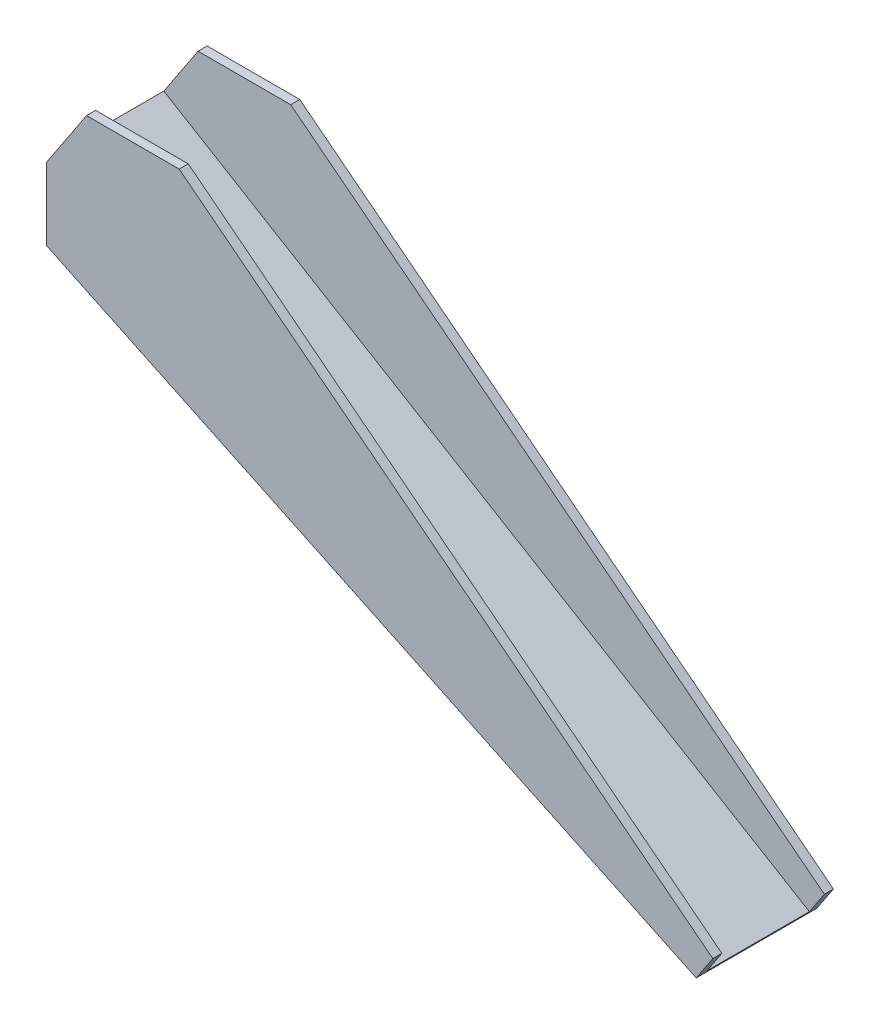
ISO-10303-21;
HEADER;
FILE_DESCRIPTION(('STEP AP214'),'2;1');
FILE_NAME('part.step','',(''),(''),'','','');
FILE_SCHEMA(('AUTOMOTIVE_DESIGN { 1 0 10303 214 1 1 1 1 }'));
ENDSEC;
DATA;
#1=APPLICATION_CONTEXT('core data for automotive mechanical design processes');
#2=APPLICATION_PROTOCOL_DEFINITION('international standard','automotive_design',2000,#1);
#3=PRODUCT_CONTEXT('',#1,'mechanical');
#4=PRODUCT('Part','Part','',(#3));
#5=PRODUCT_RELATED_PRODUCT_CATEGORY('part','',(#4));
#6=PRODUCT_DEFINITION_FORMATION('','',#4);
#7=PRODUCT_DEFINITION_CONTEXT('part definition',#1,'design');
#8=PRODUCT_DEFINITION('design','',#6,#7);
#9=PRODUCT_DEFINITION_SHAPE('','',#8);
#10=(LENGTH_UNIT() NAMED_UNIT(*) SI_UNIT(.MILLI.,.METRE.));
#11=(NAMED_UNIT(*) PLANE_ANGLE_UNIT() SI_UNIT($,.RADIAN.));
#12=(NAMED_UNIT(*) SI_UNIT($,.STERADIAN.) SOLID_ANGLE_UNIT());
#13=UNCERTAINTY_MEASURE_WITH_UNIT(LENGTH_MEASURE(1.E-05),#10,'distance_accuracy_value','');
#14=(GEOMETRIC_REPRESENTATION_CONTEXT(3) GLOBAL_UNCERTAINTY_ASSIGNED_CONTEXT((#13)) GLOBAL_UNIT_ASSIGNED_CONTEXT((#10,
#11,#12)) REPRESENTATION_CONTEXT('',''));
#15=CARTESIAN_POINT('',(0.,0.,0.));
#16=DIRECTION('',(0.,0.,1.));
#17=DIRECTION('',(1.,0.,0.));
#18=AXIS2_PLACEMENT_3D('',#15,#16,#17);
#19=CARTESIAN_POINT('',(0.,1.5,0.));
#20=DIRECTION('',(0.,1.,0.));
#21=DIRECTION('',(0.,0.,1.));
#22=AXIS2_PLACEMENT_3D('',#19,#20,#21);
#23=PLANE('',#22);
#24=CARTESIAN_POINT('',(14.5,1.5,0.));
#25=DIRECTION('',(0.,-1.,0.));
#26=DIRECTION('',(0.,0.,-1.));
#27=AXIS2_PLACEMENT_3D('',#24,#25,#26);
#28=CIRCLE('',#27,0.749999999999989);
#29=CARTESIAN_POINT('',(14.5,1.5,-0.749999999999989));
#30=VERTEX_POINT('',#29);
#31=EDGE_CURVE('E476',#30,#30,#28,.T.);
#32=ORIENTED_EDGE('',*,*,#31,.F.);
#33=EDGE_LOOP('',(#32));
#34=FACE_BOUND('',#33,.T.);
#35=CARTESIAN_POINT('',(4.5,1.5,0.));
#36=DIRECTION('',(0.,-1.,0.));
#37=DIRECTION('',(0.,0.,-1.));
#38=AXIS2_PLACEMENT_3D('',#35,#36,#37);
#39=CIRCLE('',#38,0.749999999999989);
#40=CARTESIAN_POINT('',(4.5,1.5,-0.749999999999989));
#41=VERTEX_POINT('',#40);
#42=EDGE_CURVE('E154',#41,#41,#39,.T.);
#43=ORIENTED_EDGE('',*,*,#42,.F.);
#44=EDGE_LOOP('',(#43));
#45=FACE_BOUND('',#44,.T.);
#46=CARTESIAN_POINT('',(0.,1.5,0.));
#47=DIRECTION('',(0.,-1.,0.));
#48=DIRECTION('',(0.,0.,-1.));
#49=AXIS2_PLACEMENT_3D('',#46,#47,#48);
#50=CIRCLE('',#49,2.5);
#51=CARTESIAN_POINT('',(2.14203091303816,1.5,-1.28907081558342));
#52=VERTEX_POINT('',#51);
#53=CARTESIAN_POINT('',(2.14203091303816,1.5,1.28907081558342));
#54=VERTEX_POINT('',#53);
#55=EDGE_CURVE('E153',#52,#54,#50,.T.);
#56=ORIENTED_EDGE('',*,*,#55,.F.);
#57=DIRECTION('',(0.,0.,-1.));
#58=VECTOR('',#57,1.);
#59=CARTESIAN_POINT('',(2.14203091303816,1.5,0.));
#60=LINE('',#59,#58);
#61=CARTESIAN_POINT('',(2.14203091303816,1.5,-3.79879174117364));
#62=VERTEX_POINT('',#61);
#63=EDGE_CURVE('E165',#52,#62,#60,.T.);
#64=ORIENTED_EDGE('',*,*,#63,.T.);
#65=DIRECTION('',(-0.994634834610756,0.,-0.103448275862069));
#66=VECTOR('',#65,1.);
#67=CARTESIAN_POINT('',(0.413793103448276,1.5,-3.97853933844302));
#68=LINE('',#67,#66);
#69=CARTESIAN_POINT('',(14.7586206896552,1.5,-2.48658708652689));
#70=VERTEX_POINT('',#69);
#71=EDGE_CURVE('E170',#70,#62,#68,.T.);
#72=ORIENTED_EDGE('',*,*,#71,.F.);
#73=CARTESIAN_POINT('',(14.5,1.5,0.));
#74=DIRECTION('',(0.,1.,0.));
#75=DIRECTION('',(0.,0.,1.));
#76=AXIS2_PLACEMENT_3D('',#73,#74,#75);
#77=CIRCLE('',#76,2.5);
#78=CARTESIAN_POINT('',(14.7586206896552,1.5,2.48658708652689));
#79=VERTEX_POINT('',#78);
#80=EDGE_CURVE('E166',#79,#70,#77,.T.);
#81=ORIENTED_EDGE('',*,*,#80,.F.);
#82=DIRECTION('',(0.994634834610756,0.,-0.103448275862069));
#83=VECTOR('',#82,1.);
#84=CARTESIAN_POINT('',(0.413793103448276,1.5,3.97853933844302));
#85=LINE('',#84,#83);
#86=CARTESIAN_POINT('',(2.14203091303816,1.5,3.79879174117364));
#87=VERTEX_POINT('',#86);
#88=EDGE_CURVE('E169',#87,#79,#85,.T.);
#89=ORIENTED_EDGE('',*,*,#88,.F.);
#90=EDGE_CURVE('E179',#87,#54,#60,.T.);
#91=ORIENTED_EDGE('',*,*,#90,.T.);
#92=EDGE_LOOP('',(#56,#64,#72,#81,#89,#91));
#93=FACE_BOUND('',#92,.T.);
#94=ADVANCED_FACE('F34',(#34,#45,#93),#23,.F.);
#95=CARTESIAN_POINT('',(85.7670268284741,-38.3345713536529,10.));
#96=DIRECTION('',(-0.833333333333334,0.552770798392566,0.));
#97=DIRECTION('',(-0.552770798392566,-0.833333333333334,0.));
#98=AXIS2_PLACEMENT_3D('',#95,#96,#97);
#99=PLANE('',#98);
#100=DIRECTION('',(-0.552770798392566,-0.833333333333334,0.));
#101=VECTOR('',#100,1.);
#102=CARTESIAN_POINT('',(85.7670268284741,-38.3345713536529,8.5));
#103=LINE('',#102,#101);
#104=CARTESIAN_POINT('',(88.5308808204369,-34.1679046869862,8.5));
#105=VERTEX_POINT('',#104);
#106=CARTESIAN_POINT('',(86.0436877565603,-37.9174893115559,8.5));
#107=VERTEX_POINT('',#106);
#108=EDGE_CURVE('E206',#105,#107,#103,.T.);
#109=ORIENTED_EDGE('',*,*,#108,.F.);
#110=DIRECTION('',(0.,0.,-1.));
#111=VECTOR('',#110,1.);
#112=CARTESIAN_POINT('',(88.5308808204369,-34.1679046869862,10.));
#113=LINE('',#112,#111);
#114=CARTESIAN_POINT('',(88.5308808204369,-34.1679046869862,10.));
#115=VERTEX_POINT('',#114);
#116=EDGE_CURVE('E249',#115,#105,#113,.T.);
#117=ORIENTED_EDGE('',*,*,#116,.F.);
#118=DIRECTION('',(0.552770798392566,0.833333333333334,0.));
#119=VECTOR('',#118,1.);
#120=CARTESIAN_POINT('',(85.7670268284741,-38.3345713536529,10.));
#121=LINE('',#120,#119);
#122=CARTESIAN_POINT('',(85.7670268284741,-38.3345713536529,10.));
#123=VERTEX_POINT('',#122);
#124=EDGE_CURVE('E215',#123,#115,#121,.T.);
#125=ORIENTED_EDGE('',*,*,#124,.F.);
#126=DIRECTION('',(0.,0.,-1.));
#127=VECTOR('',#126,1.);
#128=CARTESIAN_POINT('',(85.7670268284741,-38.3345713536529,10.));
#129=LINE('',#128,#127);
#130=CARTESIAN_POINT('',(85.7670268284741,-38.3345713536529,-10.));
#131=VERTEX_POINT('',#130);
#132=EDGE_CURVE('E252',#123,#131,#129,.T.);
#133=ORIENTED_EDGE('',*,*,#132,.T.);
#134=DIRECTION('',(0.552770798392566,0.833333333333334,0.));
#135=VECTOR('',#134,1.);
#136=CARTESIAN_POINT('',(85.7670268284741,-38.3345713536529,-10.));
#137=LINE('',#136,#135);
#138=CARTESIAN_POINT('',(88.5308808204369,-34.1679046869862,-10.));
#139=VERTEX_POINT('',#138);
#140=EDGE_CURVE('E228',#131,#139,#137,.T.);
#141=ORIENTED_EDGE('',*,*,#140,.T.);
#142=CARTESIAN_POINT('',(88.5308808204369,-34.1679046869862,-8.5));
#143=VERTEX_POINT('',#142);
#144=EDGE_CURVE('E248',#143,#139,#113,.T.);
#145=ORIENTED_EDGE('',*,*,#144,.F.);
#146=DIRECTION('',(0.552770798392566,0.833333333333334,0.));
#147=VECTOR('',#146,1.);
#148=CARTESIAN_POINT('',(85.7670268284741,-38.3345713536529,-8.5));
#149=LINE('',#148,#147);
#150=CARTESIAN_POINT('',(86.0436877565603,-37.9174893115559,-8.5));
#151=VERTEX_POINT('',#150);
#152=EDGE_CURVE('E200',#151,#143,#149,.T.);
#153=ORIENTED_EDGE('',*,*,#152,.F.);
#154=DIRECTION('',(0.,0.,1.));
#155=VECTOR('',#154,1.);
#156=CARTESIAN_POINT('',(86.0436877565603,-37.9174893115559,10.));
#157=LINE('',#156,#155);
#158=EDGE_CURVE('E193',#151,#107,#157,.T.);
#159=ORIENTED_EDGE('',*,*,#158,.T.);
#160=EDGE_LOOP('',(#109,#117,#125,#133,#141,#145,#153,#159));
#161=FACE_BOUND('',#160,.T.);
#162=ADVANCED_FACE('F282',(#161),#99,.F.);
#163=CARTESIAN_POINT('',(88.5308808204369,-34.1679046869862,10.));
#164=DIRECTION('',(-0.615661475325657,-0.788010753606723,0.));
#165=DIRECTION('',(0.788010753606723,-0.615661475325657,0.));
#166=AXIS2_PLACEMENT_3D('',#163,#164,#165);
#167=PLANE('',#166);
#168=DIRECTION('',(0.788010753606723,-0.615661475325657,0.));
#169=VECTOR('',#168,1.);
#170=CARTESIAN_POINT('',(88.5308808204369,-34.1679046869862,8.5));
#171=LINE('',#170,#169);
#172=CARTESIAN_POINT('',(0.,35.,8.5));
#173=VERTEX_POINT('',#172);
#174=EDGE_CURVE('E204',#173,#105,#171,.T.);
#175=ORIENTED_EDGE('',*,*,#174,.F.);
#176=DIRECTION('',(0.,0.,-1.));
#177=VECTOR('',#176,1.);
#178=CARTESIAN_POINT('',(0.,35.,10.));
#179=LINE('',#178,#177);
#180=CARTESIAN_POINT('',(0.,35.,10.));
#181=VERTEX_POINT('',#180);
#182=EDGE_CURVE('E245',#181,#173,#179,.T.);
#183=ORIENTED_EDGE('',*,*,#182,.F.);
#184=DIRECTION('',(-0.788010753606723,0.615661475325657,0.));
#185=VECTOR('',#184,1.);
#186=CARTESIAN_POINT('',(88.5308808204369,-34.1679046869862,10.));
#187=LINE('',#186,#185);
#188=EDGE_CURVE('E217',#115,#181,#187,.T.);
#189=ORIENTED_EDGE('',*,*,#188,.F.);
#190=ORIENTED_EDGE('',*,*,#116,.T.);
#191=EDGE_LOOP('',(#175,#183,#189,#190));
#192=FACE_BOUND('',#191,.T.);
#193=ADVANCED_FACE('F286',(#192),#167,.F.);
#194=DIRECTION('',(-0.788010753606723,0.615661475325657,0.));
#195=VECTOR('',#194,1.);
#196=CARTESIAN_POINT('',(88.5308808204369,-34.1679046869862,-8.5));
#197=LINE('',#196,#195);
#198=CARTESIAN_POINT('',(0.,35.,-8.5));
#199=VERTEX_POINT('',#198);
#200=EDGE_CURVE('E198',#143,#199,#197,.T.);
#201=ORIENTED_EDGE('',*,*,#200,.F.);
#202=ORIENTED_EDGE('',*,*,#144,.T.);
#203=DIRECTION('',(-0.788010753606723,0.615661475325657,0.));
#204=VECTOR('',#203,1.);
#205=CARTESIAN_POINT('',(88.5308808204369,-34.1679046869862,-10.));
#206=LINE('',#205,#204);
#207=CARTESIAN_POINT('',(0.,35.,-10.));
#208=VERTEX_POINT('',#207);
#209=EDGE_CURVE('E231',#139,#208,#206,.T.);
#210=ORIENTED_EDGE('',*,*,#209,.T.);
#211=EDGE_CURVE('E244',#199,#208,#179,.T.);
#212=ORIENTED_EDGE('',*,*,#211,.F.);
#213=EDGE_LOOP('',(#201,#202,#210,#212));
#214=FACE_BOUND('',#213,.T.);
#215=ADVANCED_FACE('F305',(#214),#167,.F.);
#216=CARTESIAN_POINT('',(-15.3667504192892,35.,10.));
#217=DIRECTION('',(0.,-1.,0.));
#218=DIRECTION('',(0.,0.,-1.));
#219=AXIS2_PLACEMENT_3D('',#216,#217,#218);
#220=PLANE('',#219);
#221=DIRECTION('',(1.,0.,0.));
#222=VECTOR('',#221,1.);
#223=CARTESIAN_POINT('',(-15.3667504192892,35.,8.5));
#224=LINE('',#223,#222);
#225=CARTESIAN_POINT('',(-15.3667504192892,35.,8.5));
#226=VERTEX_POINT('',#225);
#227=EDGE_CURVE('E202',#226,#173,#224,.T.);
#228=ORIENTED_EDGE('',*,*,#227,.F.);
#229=DIRECTION('',(0.,0.,-1.));
#230=VECTOR('',#229,1.);
#231=CARTESIAN_POINT('',(-15.3667504192892,35.,10.));
#232=LINE('',#231,#230);
#233=CARTESIAN_POINT('',(-15.3667504192892,35.,10.));
#234=VERTEX_POINT('',#233);
#235=EDGE_CURVE('E241',#234,#226,#232,.T.);
#236=ORIENTED_EDGE('',*,*,#235,.F.);
#237=DIRECTION('',(-1.,0.,0.));
#238=VECTOR('',#237,1.);
#239=CARTESIAN_POINT('',(-15.3667504192892,35.,10.));
#240=LINE('',#239,#238);
#241=EDGE_CURVE('E219',#181,#234,#240,.T.);
#242=ORIENTED_EDGE('',*,*,#241,.F.);
#243=ORIENTED_EDGE('',*,*,#182,.T.);
#244=EDGE_LOOP('',(#228,#236,#242,#243));
#245=FACE_BOUND('',#244,.T.);
#246=ADVANCED_FACE('F314',(#245),#220,.F.);
#247=DIRECTION('',(-1.,0.,0.));
#248=VECTOR('',#247,1.);
#249=CARTESIAN_POINT('',(-15.3667504192892,35.,-8.5));
#250=LINE('',#249,#248);
#251=CARTESIAN_POINT('',(-15.3667504192892,35.,-8.5));
#252=VERTEX_POINT('',#251);
#253=EDGE_CURVE('E196',#199,#252,#250,.T.);
#254=ORIENTED_EDGE('',*,*,#253,.F.);
#255=ORIENTED_EDGE('',*,*,#211,.T.);
#256=DIRECTION('',(-1.,0.,0.));
#257=VECTOR('',#256,1.);
#258=CARTESIAN_POINT('',(-15.3667504192892,35.,-10.));
#259=LINE('',#258,#257);
#260=CARTESIAN_POINT('',(-15.3667504192892,35.,-10.));
#261=VERTEX_POINT('',#260);
#262=EDGE_CURVE('E234',#208,#261,#259,.T.);
#263=ORIENTED_EDGE('',*,*,#262,.T.);
#264=EDGE_CURVE('E240',#252,#261,#232,.T.);
#265=ORIENTED_EDGE('',*,*,#264,.F.);
#266=EDGE_LOOP('',(#254,#255,#263,#265));
#267=FACE_BOUND('',#266,.T.);
#268=ADVANCED_FACE('F307',(#267),#220,.F.);
#269=CARTESIAN_POINT('',(-15.3667504192892,35.,10.));
#270=DIRECTION('',(0.833333333333333,-0.552770798392566,0.));
#271=DIRECTION('',(0.552770798392566,0.833333333333334,0.));
#272=AXIS2_PLACEMENT_3D('',#269,#270,#271);
#273=PLANE('',#272);
#274=DIRECTION('',(0.552770798392566,0.833333333333334,0.));
#275=VECTOR('',#274,1.);
#276=CARTESIAN_POINT('',(-15.3667504192892,35.,8.5));
#277=LINE('',#276,#275);
#278=CARTESIAN_POINT('',(-21.0506112067681,26.4312574578719,8.5));
#279=VERTEX_POINT('',#278);
#280=EDGE_CURVE('E11',#279,#226,#277,.T.);
#281=ORIENTED_EDGE('',*,*,#280,.F.);
#282=DIRECTION('',(0.,0.,-1.));
#283=VECTOR('',#282,1.);
#284=CARTESIAN_POINT('',(-21.0506112067682,26.4312574578719,10.));
#285=LINE('',#284,#283);
#286=CARTESIAN_POINT('',(-21.0506112067682,26.4312574578719,-8.5));
#287=VERTEX_POINT('',#286);
#288=EDGE_CURVE('E258',#279,#287,#285,.T.);
#289=ORIENTED_EDGE('',*,*,#288,.T.);
#290=DIRECTION('',(-0.552770798392566,-0.833333333333334,0.));
#291=VECTOR('',#290,1.);
#292=CARTESIAN_POINT('',(-15.3667504192892,35.,-8.5));
#293=LINE('',#292,#291);
#294=EDGE_CURVE('E43',#252,#287,#293,.T.);
#295=ORIENTED_EDGE('',*,*,#294,.F.);
#296=ORIENTED_EDGE('',*,*,#264,.T.);
#297=DIRECTION('',(-0.552770798392566,-0.833333333333333,0.));
#298=VECTOR('',#297,1.);
#299=CARTESIAN_POINT('',(-15.3667504192892,35.,-10.));
#300=LINE('',#299,#298);
#301=CARTESIAN_POINT('',(-22.,25.,-10.));
#302=VERTEX_POINT('',#301);
#303=EDGE_CURVE('E213',#261,#302,#300,.T.);
#304=ORIENTED_EDGE('',*,*,#303,.T.);
#305=DIRECTION('',(0.,0.,-1.));
#306=VECTOR('',#305,1.);
#307=CARTESIAN_POINT('',(-22.,25.,10.));
#308=LINE('',#307,#306);
#309=CARTESIAN_POINT('',(-22.,25.,10.));
#310=VERTEX_POINT('',#309);
#311=EDGE_CURVE('E223',#310,#302,#308,.T.);
#312=ORIENTED_EDGE('',*,*,#311,.F.);
#313=DIRECTION('',(-0.552770798392566,-0.833333333333333,0.));
#314=VECTOR('',#313,1.);
#315=CARTESIAN_POINT('',(-15.3667504192892,35.,10.));
#316=LINE('',#315,#314);
#317=EDGE_CURVE('E221',#234,#310,#316,.T.);
#318=ORIENTED_EDGE('',*,*,#317,.F.);
#319=ORIENTED_EDGE('',*,*,#235,.T.);
#320=EDGE_LOOP('',(#281,#289,#295,#296,#304,#312,#318,#319));
#321=FACE_BOUND('',#320,.T.);
#322=ADVANCED_FACE('F271',(#321),#273,.F.);
#323=CARTESIAN_POINT('',(-22.,25.,10.));
#324=DIRECTION('',(1.,0.,0.));
#325=DIRECTION('',(0.,1.,0.));
#326=AXIS2_PLACEMENT_3D('',#323,#324,#325);
#327=PLANE('',#326);
#328=DIRECTION('',(0.,-1.,0.));
#329=VECTOR('',#328,1.);
#330=CARTESIAN_POINT('',(-22.,25.,-10.));
#331=LINE('',#330,#329);
#332=CARTESIAN_POINT('',(-22.,13.,-10.));
#333=VERTEX_POINT('',#332);
#334=EDGE_CURVE('E208',#302,#333,#331,.T.);
#335=ORIENTED_EDGE('',*,*,#334,.T.);
#336=DIRECTION('',(0.,0.,-1.));
#337=VECTOR('',#336,1.);
#338=CARTESIAN_POINT('',(-22.,13.,10.));
#339=LINE('',#338,#337);
#340=CARTESIAN_POINT('',(-22.,13.,10.));
#341=VERTEX_POINT('',#340);
#342=EDGE_CURVE('E255',#341,#333,#339,.T.);
#343=ORIENTED_EDGE('',*,*,#342,.F.);
#344=DIRECTION('',(0.,-1.,0.));
#345=VECTOR('',#344,1.);
#346=CARTESIAN_POINT('',(-22.,25.,10.));
#347=LINE('',#346,#345);
#348=EDGE_CURVE('E209',#310,#341,#347,.T.);
#349=ORIENTED_EDGE('',*,*,#348,.F.);
#350=ORIENTED_EDGE('',*,*,#311,.T.);
#351=EDGE_LOOP('',(#335,#343,#349,#350));
#352=FACE_BOUND('',#351,.T.);
#353=ADVANCED_FACE('F36',(#352),#327,.F.);
#354=CARTESIAN_POINT('',(85.7670268284741,-38.3345713536529,10.));
#355=DIRECTION('',(0.430049254912396,0.902805426628182,0.));
#356=DIRECTION('',(-0.902805426628182,0.430049254912396,0.));
#357=AXIS2_PLACEMENT_3D('',#354,#355,#356);
#358=PLANE('',#357);
#359=ORIENTED_EDGE('',*,*,#63,.F.);
#360=CARTESIAN_POINT('',(0.,2.52035141901154,0.));
#361=DIRECTION('',(0.430049254912396,0.902805426628182,0.));
#362=DIRECTION('',(0.902805426628182,-0.430049254912396,0.));
#363=AXIS2_PLACEMENT_3D('',#360,#361,#362);
#364=ELLIPSE('',#363,2.76914596020657,2.5);
#365=EDGE_CURVE('E49',#52,#54,#364,.T.);
#366=ORIENTED_EDGE('',*,*,#365,.T.);
#367=ORIENTED_EDGE('',*,*,#90,.F.);
#368=DIRECTION('',(-0.898851656483055,0.428165885744626,0.093486223167848));
#369=VECTOR('',#368,1.);
#370=CARTESIAN_POINT('',(16.062031939453,-5.13075995471939,2.35102412227219));
#371=LINE('',#370,#369);
#372=CARTESIAN_POINT('',(14.7586206896552,-4.50988305224718,2.48658708652689));
#373=VERTEX_POINT('',#372);
#374=EDGE_CURVE('E57',#373,#87,#371,.T.);
#375=ORIENTED_EDGE('',*,*,#374,.F.);
#376=CARTESIAN_POINT('',(14.5,-4.38668969118541,0.));
#377=DIRECTION('',(0.430049254912396,0.902805426628182,0.));
#378=DIRECTION('',(-0.902805426628182,0.430049254912396,0.));
#379=AXIS2_PLACEMENT_3D('',#376,#377,#378);
#380=ELLIPSE('',#379,2.76914596020657,2.5);
#381=CARTESIAN_POINT('',(14.7586206896552,-4.50988305224718,-2.48658708652689));
#382=VERTEX_POINT('',#381);
#383=EDGE_CURVE('E173',#382,#373,#380,.F.);
#384=ORIENTED_EDGE('',*,*,#383,.F.);
#385=DIRECTION('',(0.898851656483055,-0.428165885744626,0.093486223167848));
#386=VECTOR('',#385,1.);
#387=CARTESIAN_POINT('',(16.062031939453,-5.13075995471939,-2.35102412227219));
#388=LINE('',#387,#386);
#389=EDGE_CURVE('E176',#62,#382,#388,.T.);
#390=ORIENTED_EDGE('',*,*,#389,.F.);
#391=EDGE_LOOP('',(#359,#366,#367,#375,#384,#390));
#392=FACE_BOUND('',#391,.T.);
#393=DIRECTION('',(0.902805426628182,-0.430049254912396,0.));
#394=VECTOR('',#393,1.);
#395=CARTESIAN_POINT('',(85.7670268284741,-38.3345713536529,-10.));
#396=LINE('',#395,#394);
#397=EDGE_CURVE('E226',#333,#131,#396,.T.);
#398=ORIENTED_EDGE('',*,*,#397,.T.);
#399=ORIENTED_EDGE('',*,*,#132,.F.);
#400=DIRECTION('',(0.902805426628182,-0.430049254912396,0.));
#401=VECTOR('',#400,1.);
#402=CARTESIAN_POINT('',(85.7670268284741,-38.3345713536529,10.));
#403=LINE('',#402,#401);
#404=EDGE_CURVE('E212',#341,#123,#403,.T.);
#405=ORIENTED_EDGE('',*,*,#404,.F.);
#406=ORIENTED_EDGE('',*,*,#342,.T.);
#407=EDGE_LOOP('',(#398,#399,#405,#406));
#408=FACE_BOUND('',#407,.T.);
#409=ADVANCED_FACE('F345',(#392,#408),#358,.F.);
#410=CARTESIAN_POINT('',(0.,0.,10.));
#411=DIRECTION('',(0.,0.,1.));
#412=DIRECTION('',(1.,0.,0.));
#413=AXIS2_PLACEMENT_3D('',#410,#411,#412);
#414=PLANE('',#413);
#415=ORIENTED_EDGE('',*,*,#348,.T.);
#416=ORIENTED_EDGE('',*,*,#404,.T.);
#417=ORIENTED_EDGE('',*,*,#124,.T.);
#418=ORIENTED_EDGE('',*,*,#188,.T.);
#419=ORIENTED_EDGE('',*,*,#241,.T.);
#420=ORIENTED_EDGE('',*,*,#317,.T.);
#421=EDGE_LOOP('',(#415,#416,#417,#418,#419,#420));
#422=FACE_BOUND('',#421,.T.);
#423=ADVANCED_FACE('F290',(#422),#414,.T.);
#424=CARTESIAN_POINT('',(0.,0.,-10.));
#425=DIRECTION('',(0.,0.,1.));
#426=DIRECTION('',(1.,0.,0.));
#427=AXIS2_PLACEMENT_3D('',#424,#425,#426);
#428=PLANE('',#427);
#429=ORIENTED_EDGE('',*,*,#334,.F.);
#430=ORIENTED_EDGE('',*,*,#303,.F.);
#431=ORIENTED_EDGE('',*,*,#262,.F.);
#432=ORIENTED_EDGE('',*,*,#209,.F.);
#433=ORIENTED_EDGE('',*,*,#140,.F.);
#434=ORIENTED_EDGE('',*,*,#397,.F.);
#435=EDGE_LOOP('',(#429,#430,#431,#432,#433,#434));
#436=FACE_BOUND('',#435,.T.);
#437=ADVANCED_FACE('F299',(#436),#428,.F.);
#438=CARTESIAN_POINT('',(96.5165356347815,-20.8775432263387,8.5));
#439=DIRECTION('',(0.,0.,-1.));
#440=DIRECTION('',(-1.,0.,0.));
#441=AXIS2_PLACEMENT_3D('',#438,#439,#440);
#442=PLANE('',#441);
#443=ORIENTED_EDGE('',*,*,#108,.T.);
#444=DIRECTION('',(0.857167300702113,-0.515038074910052,0.));
#445=VECTOR('',#444,1.);
#446=CARTESIAN_POINT('',(86.2157741365805,-38.020889240381,8.5));
#447=LINE('',#446,#445);
#448=EDGE_CURVE('E188',#279,#107,#447,.T.);
#449=ORIENTED_EDGE('',*,*,#448,.F.);
#450=ORIENTED_EDGE('',*,*,#280,.T.);
#451=ORIENTED_EDGE('',*,*,#227,.T.);
#452=ORIENTED_EDGE('',*,*,#174,.T.);
#453=EDGE_LOOP('',(#443,#449,#450,#451,#452));
#454=FACE_BOUND('',#453,.T.);
#455=ADVANCED_FACE('F276',(#454),#442,.T.);
#456=CARTESIAN_POINT('',(96.5165356347815,-20.8775432263387,-8.5));
#457=DIRECTION('',(0.,0.,1.));
#458=DIRECTION('',(1.,0.,0.));
#459=AXIS2_PLACEMENT_3D('',#456,#457,#458);
#460=PLANE('',#459);
#461=ORIENTED_EDGE('',*,*,#152,.T.);
#462=ORIENTED_EDGE('',*,*,#200,.T.);
#463=ORIENTED_EDGE('',*,*,#253,.T.);
#464=ORIENTED_EDGE('',*,*,#294,.T.);
#465=DIRECTION('',(-0.857167300702113,0.515038074910052,0.));
#466=VECTOR('',#465,1.);
#467=CARTESIAN_POINT('',(86.2157741365805,-38.020889240381,-8.5));
#468=LINE('',#467,#466);
#469=EDGE_CURVE('E191',#151,#287,#468,.T.);
#470=ORIENTED_EDGE('',*,*,#469,.F.);
#471=EDGE_LOOP('',(#461,#462,#463,#464,#470));
#472=FACE_BOUND('',#471,.T.);
#473=ADVANCED_FACE('F265',(#472),#460,.T.);
#474=CARTESIAN_POINT('',(6.08473364136704,10.1266973548952,0.));
#475=DIRECTION('',(-0.515038074910052,-0.857167300702114,0.));
#476=DIRECTION('',(0.857167300702114,-0.515038074910052,0.));
#477=AXIS2_PLACEMENT_3D('',#474,#475,#476);
#478=PLANE('',#477);
#479=CARTESIAN_POINT('',(14.5,5.07029520136521,0.));
#480=DIRECTION('',(-0.515038074910052,-0.857167300702114,0.));
#481=DIRECTION('',(0.857167300702114,-0.515038074910052,0.));
#482=AXIS2_PLACEMENT_3D('',#479,#480,#481);
#483=ELLIPSE('',#482,0.874975047911488,0.749999999999993);
#484=CARTESIAN_POINT('',(15.25,4.61964973709454,0.));
#485=VERTEX_POINT('',#484);
#486=EDGE_CURVE('E38',#485,#485,#483,.T.);
#487=ORIENTED_EDGE('',*,*,#486,.T.);
#488=EDGE_LOOP('',(#487));
#489=FACE_BOUND('',#488,.T.);
#490=CARTESIAN_POINT('',(0.,13.7827741772648,0.));
#491=DIRECTION('',(-0.515038074910052,-0.857167300702114,0.));
#492=DIRECTION('',(0.857167300702114,-0.515038074910052,0.));
#493=AXIS2_PLACEMENT_3D('',#490,#491,#492);
#494=ELLIPSE('',#493,2.91658349303832,2.5);
#495=CARTESIAN_POINT('',(2.5,12.2806226296959,0.));
#496=VERTEX_POINT('',#495);
#497=EDGE_CURVE('E156',#496,#496,#494,.T.);
#498=ORIENTED_EDGE('',*,*,#497,.T.);
#499=EDGE_LOOP('',(#498));
#500=FACE_BOUND('',#499,.T.);
#501=ORIENTED_EDGE('',*,*,#469,.T.);
#502=ORIENTED_EDGE('',*,*,#288,.F.);
#503=ORIENTED_EDGE('',*,*,#448,.T.);
#504=ORIENTED_EDGE('',*,*,#158,.F.);
#505=EDGE_LOOP('',(#501,#502,#503,#504));
#506=FACE_BOUND('',#505,.T.);
#507=ADVANCED_FACE('F274',(#489,#500,#506),#478,.F.);
#508=CARTESIAN_POINT('',(0.413793103448276,-38.3365713536529,3.97853933844302));
#509=DIRECTION('',(0.103448275862069,0.,0.994634834610756));
#510=DIRECTION('',(0.994634834610756,0.,-0.103448275862069));
#511=AXIS2_PLACEMENT_3D('',#508,#509,#510);
#512=PLANE('',#511);
#513=ORIENTED_EDGE('',*,*,#374,.T.);
#514=ORIENTED_EDGE('',*,*,#88,.T.);
#515=DIRECTION('',(0.,1.,0.));
#516=VECTOR('',#515,1.);
#517=CARTESIAN_POINT('',(14.7586206896552,-38.3365713536529,2.48658708652689));
#518=LINE('',#517,#516);
#519=EDGE_CURVE('E172',#373,#79,#518,.T.);
#520=ORIENTED_EDGE('',*,*,#519,.F.);
#521=EDGE_LOOP('',(#513,#514,#520));
#522=FACE_BOUND('',#521,.T.);
#523=ADVANCED_FACE('F334',(#522),#512,.F.);
#524=CARTESIAN_POINT('',(14.5,-38.3365713536529,0.));
#525=DIRECTION('',(0.,1.,0.));
#526=DIRECTION('',(0.,0.,1.));
#527=AXIS2_PLACEMENT_3D('',#524,#525,#526);
#528=CYLINDRICAL_SURFACE('',#527,2.5);
#529=ORIENTED_EDGE('',*,*,#383,.T.);
#530=ORIENTED_EDGE('',*,*,#519,.T.);
#531=ORIENTED_EDGE('',*,*,#80,.T.);
#532=DIRECTION('',(0.,1.,0.));
#533=VECTOR('',#532,1.);
#534=CARTESIAN_POINT('',(14.7586206896552,-38.3365713536529,-2.48658708652689));
#535=LINE('',#534,#533);
#536=EDGE_CURVE('E183',#382,#70,#535,.T.);
#537=ORIENTED_EDGE('',*,*,#536,.F.);
#538=EDGE_LOOP('',(#529,#530,#531,#537));
#539=FACE_BOUND('',#538,.T.);
#540=ADVANCED_FACE('F405',(#539),#528,.F.);
#541=CARTESIAN_POINT('',(0.413793103448276,-38.3365713536529,-3.97853933844302));
#542=DIRECTION('',(0.103448275862069,0.,-0.994634834610756));
#543=DIRECTION('',(-0.994634834610756,0.,-0.103448275862069));
#544=AXIS2_PLACEMENT_3D('',#541,#542,#543);
#545=PLANE('',#544);
#546=ORIENTED_EDGE('',*,*,#389,.T.);
#547=ORIENTED_EDGE('',*,*,#536,.T.);
#548=ORIENTED_EDGE('',*,*,#71,.T.);
#549=EDGE_LOOP('',(#546,#547,#548));
#550=FACE_BOUND('',#549,.T.);
#551=ADVANCED_FACE('F413',(#550),#545,.F.);
#552=CARTESIAN_POINT('',(0.,1.5,0.));
#553=DIRECTION('',(0.,-1.,0.));
#554=DIRECTION('',(0.,0.,-1.));
#555=AXIS2_PLACEMENT_3D('',#552,#553,#554);
#556=CYLINDRICAL_SURFACE('',#555,2.5);
#557=ORIENTED_EDGE('',*,*,#497,.F.);
#558=EDGE_LOOP('',(#557));
#559=FACE_BOUND('',#558,.T.);
#560=ORIENTED_EDGE('',*,*,#55,.T.);
#561=ORIENTED_EDGE('',*,*,#365,.F.);
#562=EDGE_LOOP('',(#560,#561));
#563=FACE_BOUND('',#562,.T.);
#564=ADVANCED_FACE('F147',(#559,#563),#556,.F.);
#565=CARTESIAN_POINT('',(4.5,6.5,0.));
#566=DIRECTION('',(0.,-1.,0.));
#567=DIRECTION('',(0.,0.,-1.));
#568=AXIS2_PLACEMENT_3D('',#565,#566,#567);
#569=CONICAL_SURFACE('',#568,0.749999999999998,1.02974425867665);
#570=CARTESIAN_POINT('',(4.5,6.95064546427067,0.));
#571=VERTEX_POINT('',#570);
#572=VERTEX_LOOP('',#571);
#573=FACE_BOUND('',#572,.T.);
#574=CARTESIAN_POINT('',(4.5,6.5,0.));
#575=DIRECTION('',(0.,-1.,0.));
#576=DIRECTION('',(0.,0.,-1.));
#577=AXIS2_PLACEMENT_3D('',#574,#575,#576);
#578=CIRCLE('',#577,0.749999999999998);
#579=CARTESIAN_POINT('',(4.5,6.5,-0.749999999999998));
#580=VERTEX_POINT('',#579);
#581=EDGE_CURVE('E151',#580,#580,#578,.T.);
#582=ORIENTED_EDGE('',*,*,#581,.T.);
#583=EDGE_LOOP('',(#582));
#584=FACE_BOUND('',#583,.T.);
#585=ADVANCED_FACE('F143',(#573,#584),#569,.F.);
#586=CARTESIAN_POINT('',(4.5,1.5,0.));
#587=DIRECTION('',(0.,-1.,0.));
#588=DIRECTION('',(0.,0.,-1.));
#589=AXIS2_PLACEMENT_3D('',#586,#587,#588);
#590=CYLINDRICAL_SURFACE('',#589,0.749999999999993);
#591=ORIENTED_EDGE('',*,*,#581,.F.);
#592=EDGE_LOOP('',(#591));
#593=FACE_BOUND('',#592,.T.);
#594=ORIENTED_EDGE('',*,*,#42,.T.);
#595=EDGE_LOOP('',(#594));
#596=FACE_BOUND('',#595,.T.);
#597=ADVANCED_FACE('F146',(#593,#596),#590,.F.);
#598=CARTESIAN_POINT('',(14.5,1.5,0.));
#599=DIRECTION('',(0.,-1.,0.));
#600=DIRECTION('',(0.,0.,-1.));
#601=AXIS2_PLACEMENT_3D('',#598,#599,#600);
#602=CYLINDRICAL_SURFACE('',#601,0.749999999999993);
#603=ORIENTED_EDGE('',*,*,#31,.T.);
#604=EDGE_LOOP('',(#603));
#605=FACE_BOUND('',#604,.T.);
#606=ORIENTED_EDGE('',*,*,#486,.F.);
#607=EDGE_LOOP('',(#606));
#608=FACE_BOUND('',#607,.T.);
#609=ADVANCED_FACE('F461',(#605,#608),#602,.F.);
#610=CLOSED_SHELL('',(#94,#162,#193,#215,#246,#268,#322,#353,#409,#423,#437,#455,#473,#507,#523,
#540,#551,#564,#585,#597,#609));
#611=MANIFOLD_SOLID_BREP('B2',#610);
#612=ADVANCED_BREP_SHAPE_REPRESENTATION('',(#18,#611),#14);
#613=SHAPE_DEFINITION_REPRESENTATION(#9,#612);
ENDSEC;
END-ISO-10303-21;
